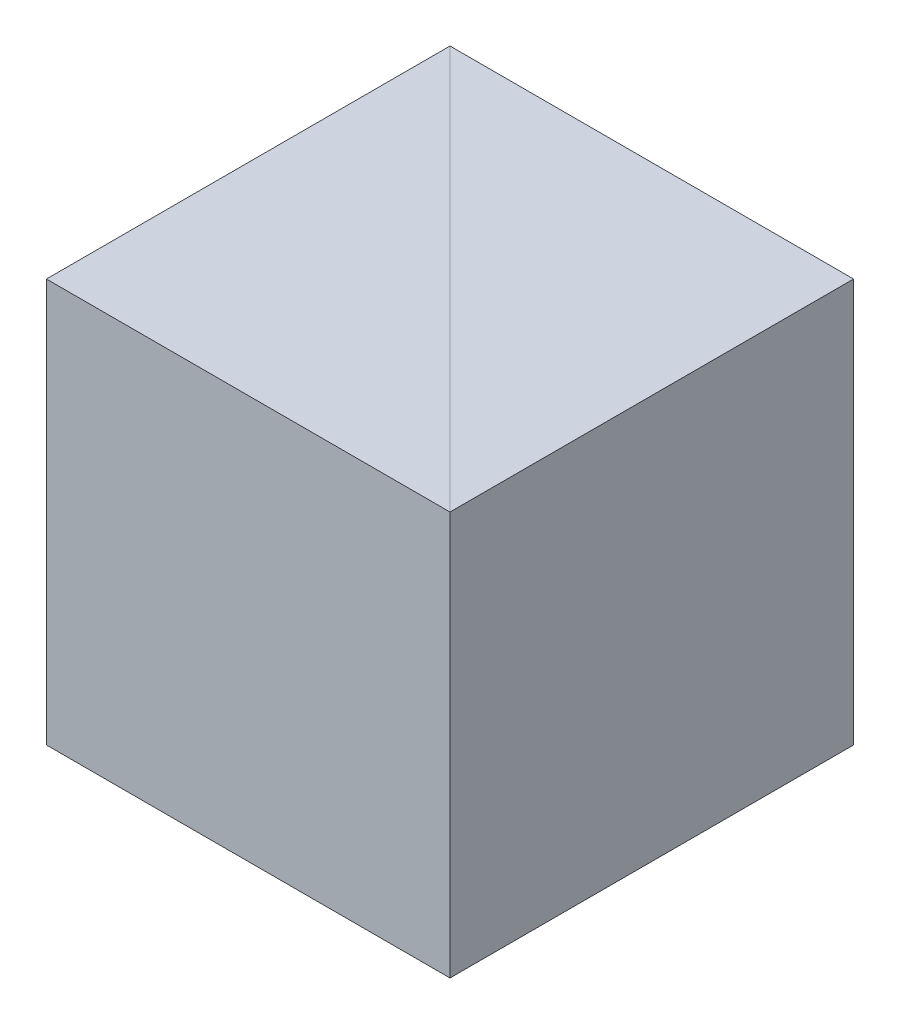
ISO-10303-21;
HEADER;
FILE_DESCRIPTION(('STEP AP214'),'2;1');
FILE_NAME('part.step','',(''),(''),'','','');
FILE_SCHEMA(('AUTOMOTIVE_DESIGN { 1 0 10303 214 1 1 1 1 }'));
ENDSEC;
DATA;
#1=APPLICATION_CONTEXT('core data for automotive mechanical design processes');
#2=APPLICATION_PROTOCOL_DEFINITION('international standard','automotive_design',2000,#1);
#3=PRODUCT_CONTEXT('',#1,'mechanical');
#4=PRODUCT('Part','Part','',(#3));
#5=PRODUCT_RELATED_PRODUCT_CATEGORY('part','',(#4));
#6=PRODUCT_DEFINITION_FORMATION('','',#4);
#7=PRODUCT_DEFINITION_CONTEXT('part definition',#1,'design');
#8=PRODUCT_DEFINITION('design','',#6,#7);
#9=PRODUCT_DEFINITION_SHAPE('','',#8);
#10=(LENGTH_UNIT() NAMED_UNIT(*) SI_UNIT(.MILLI.,.METRE.));
#11=(NAMED_UNIT(*) PLANE_ANGLE_UNIT() SI_UNIT($,.RADIAN.));
#12=(NAMED_UNIT(*) SI_UNIT($,.STERADIAN.) SOLID_ANGLE_UNIT());
#13=UNCERTAINTY_MEASURE_WITH_UNIT(LENGTH_MEASURE(1.E-05),#10,'distance_accuracy_value','');
#14=(GEOMETRIC_REPRESENTATION_CONTEXT(3) GLOBAL_UNCERTAINTY_ASSIGNED_CONTEXT((#13)) GLOBAL_UNIT_ASSIGNED_CONTEXT((#10,
#11,#12)) REPRESENTATION_CONTEXT('',''));
#15=CARTESIAN_POINT('',(0.,0.,0.));
#16=DIRECTION('',(0.,0.,1.));
#17=DIRECTION('',(1.,0.,0.));
#18=AXIS2_PLACEMENT_3D('',#15,#16,#17);
#19=CARTESIAN_POINT('',(0.,20.,0.));
#20=DIRECTION('',(0.707106781186547,0.,-0.707106781186548));
#21=DIRECTION('',(-0.707106781186548,0.,-0.707106781186547));
#22=AXIS2_PLACEMENT_3D('',#19,#20,#21);
#23=PLANE('',#22);
#24=DIRECTION('',(0.707106781186548,0.,0.707106781186547));
#25=VECTOR('',#24,1.);
#26=CARTESIAN_POINT('',(0.,0.,0.));
#27=LINE('',#26,#25);
#28=CARTESIAN_POINT('',(-20.,0.,-20.));
#29=VERTEX_POINT('',#28);
#30=CARTESIAN_POINT('',(0.,0.,0.));
#31=VERTEX_POINT('',#30);
#32=EDGE_CURVE('E99',#29,#31,#27,.T.);
#33=ORIENTED_EDGE('',*,*,#32,.F.);
#34=DIRECTION('',(0.,-1.,0.));
#35=VECTOR('',#34,1.);
#36=CARTESIAN_POINT('',(-20.,20.,-20.));
#37=LINE('',#36,#35);
#38=CARTESIAN_POINT('',(-20.,20.,-20.));
#39=VERTEX_POINT('',#38);
#40=EDGE_CURVE('E12',#39,#29,#37,.T.);
#41=ORIENTED_EDGE('',*,*,#40,.F.);
#42=DIRECTION('',(0.707106781186548,0.,0.707106781186547));
#43=VECTOR('',#42,1.);
#44=CARTESIAN_POINT('',(0.,20.,0.));
#45=LINE('',#44,#43);
#46=CARTESIAN_POINT('',(0.,20.,0.));
#47=VERTEX_POINT('',#46);
#48=EDGE_CURVE('E91',#39,#47,#45,.T.);
#49=ORIENTED_EDGE('',*,*,#48,.T.);
#50=DIRECTION('',(0.,-1.,0.));
#51=VECTOR('',#50,1.);
#52=CARTESIAN_POINT('',(0.,20.,0.));
#53=LINE('',#52,#51);
#54=EDGE_CURVE('E50',#47,#31,#53,.T.);
#55=ORIENTED_EDGE('',*,*,#54,.T.);
#56=EDGE_LOOP('',(#33,#41,#49,#55));
#57=FACE_BOUND('',#56,.T.);
#58=ADVANCED_FACE('F47',(#57),#23,.T.);
#59=CARTESIAN_POINT('',(-20.,20.,-20.));
#60=DIRECTION('',(-1.,0.,0.));
#61=DIRECTION('',(0.,0.,1.));
#62=AXIS2_PLACEMENT_3D('',#59,#60,#61);
#63=PLANE('',#62);
#64=DIRECTION('',(0.,0.,-1.));
#65=VECTOR('',#64,1.);
#66=CARTESIAN_POINT('',(-20.,0.,-20.));
#67=LINE('',#66,#65);
#68=CARTESIAN_POINT('',(-20.,0.,0.));
#69=VERTEX_POINT('',#68);
#70=EDGE_CURVE('E93',#69,#29,#67,.T.);
#71=ORIENTED_EDGE('',*,*,#70,.F.);
#72=DIRECTION('',(0.,-1.,0.));
#73=VECTOR('',#72,1.);
#74=CARTESIAN_POINT('',(-20.,20.,0.));
#75=LINE('',#74,#73);
#76=CARTESIAN_POINT('',(-20.,20.,0.));
#77=VERTEX_POINT('',#76);
#78=EDGE_CURVE('E56',#77,#69,#75,.T.);
#79=ORIENTED_EDGE('',*,*,#78,.F.);
#80=DIRECTION('',(0.,0.,-1.));
#81=VECTOR('',#80,1.);
#82=CARTESIAN_POINT('',(-20.,20.,-20.));
#83=LINE('',#82,#81);
#84=EDGE_CURVE('E88',#77,#39,#83,.T.);
#85=ORIENTED_EDGE('',*,*,#84,.T.);
#86=ORIENTED_EDGE('',*,*,#40,.T.);
#87=EDGE_LOOP('',(#71,#79,#85,#86));
#88=FACE_BOUND('',#87,.T.);
#89=ADVANCED_FACE('F103',(#88),#63,.T.);
#90=CARTESIAN_POINT('',(-20.,20.,0.));
#91=DIRECTION('',(0.,0.,1.));
#92=DIRECTION('',(1.,0.,0.));
#93=AXIS2_PLACEMENT_3D('',#90,#91,#92);
#94=PLANE('',#93);
#95=DIRECTION('',(-1.,0.,0.));
#96=VECTOR('',#95,1.);
#97=CARTESIAN_POINT('',(-20.,0.,0.));
#98=LINE('',#97,#96);
#99=EDGE_CURVE('E86',#31,#69,#98,.T.);
#100=ORIENTED_EDGE('',*,*,#99,.F.);
#101=ORIENTED_EDGE('',*,*,#54,.F.);
#102=DIRECTION('',(-1.,0.,0.));
#103=VECTOR('',#102,1.);
#104=CARTESIAN_POINT('',(-20.,20.,0.));
#105=LINE('',#104,#103);
#106=EDGE_CURVE('E84',#47,#77,#105,.T.);
#107=ORIENTED_EDGE('',*,*,#106,.T.);
#108=ORIENTED_EDGE('',*,*,#78,.T.);
#109=EDGE_LOOP('',(#100,#101,#107,#108));
#110=FACE_BOUND('',#109,.T.);
#111=ADVANCED_FACE('F83',(#110),#94,.T.);
#112=CARTESIAN_POINT('',(0.,20.,0.));
#113=DIRECTION('',(0.,1.,0.));
#114=DIRECTION('',(0.,0.,1.));
#115=AXIS2_PLACEMENT_3D('',#112,#113,#114);
#116=PLANE('',#115);
#117=ORIENTED_EDGE('',*,*,#48,.F.);
#118=ORIENTED_EDGE('',*,*,#84,.F.);
#119=ORIENTED_EDGE('',*,*,#106,.F.);
#120=EDGE_LOOP('',(#117,#118,#119));
#121=FACE_BOUND('',#120,.T.);
#122=ADVANCED_FACE('F90',(#121),#116,.T.);
#123=CARTESIAN_POINT('',(0.,0.,0.));
#124=DIRECTION('',(0.,1.,0.));
#125=DIRECTION('',(0.,0.,1.));
#126=AXIS2_PLACEMENT_3D('',#123,#124,#125);
#127=PLANE('',#126);
#128=ORIENTED_EDGE('',*,*,#32,.T.);
#129=ORIENTED_EDGE('',*,*,#99,.T.);
#130=ORIENTED_EDGE('',*,*,#70,.T.);
#131=EDGE_LOOP('',(#128,#129,#130));
#132=FACE_BOUND('',#131,.T.);
#133=ADVANCED_FACE('F102',(#132),#127,.F.);
#134=CLOSED_SHELL('',(#58,#89,#111,#122,#133));
#135=MANIFOLD_SOLID_BREP('B2',#134);
#136=CARTESIAN_POINT('',(-20.,20.,-20.));
#137=DIRECTION('',(0.707106781186547,0.,-0.707106781186548));
#138=DIRECTION('',(-0.707106781186548,0.,-0.707106781186547));
#139=AXIS2_PLACEMENT_3D('',#136,#137,#138);
#140=PLANE('',#139);
#141=DIRECTION('',(0.707106781186548,0.,0.707106781186547));
#142=VECTOR('',#141,1.);
#143=CARTESIAN_POINT('',(-20.,0.,-20.));
#144=LINE('',#143,#142);
#145=CARTESIAN_POINT('',(-20.,0.,-20.));
#146=VERTEX_POINT('',#145);
#147=CARTESIAN_POINT('',(0.,0.,0.));
#148=VERTEX_POINT('',#147);
#149=EDGE_CURVE('E192',#146,#148,#144,.T.);
#150=ORIENTED_EDGE('',*,*,#149,.T.);
#151=DIRECTION('',(0.,-1.,0.));
#152=VECTOR('',#151,1.);
#153=CARTESIAN_POINT('',(0.,20.,0.));
#154=LINE('',#153,#152);
#155=CARTESIAN_POINT('',(0.,20.,0.));
#156=VERTEX_POINT('',#155);
#157=EDGE_CURVE('E45',#156,#148,#154,.T.);
#158=ORIENTED_EDGE('',*,*,#157,.F.);
#159=DIRECTION('',(0.707106781186548,0.,0.707106781186547));
#160=VECTOR('',#159,1.);
#161=CARTESIAN_POINT('',(-20.,20.,-20.));
#162=LINE('',#161,#160);
#163=CARTESIAN_POINT('',(-20.,20.,-20.));
#164=VERTEX_POINT('',#163);
#165=EDGE_CURVE('E185',#164,#156,#162,.T.);
#166=ORIENTED_EDGE('',*,*,#165,.F.);
#167=DIRECTION('',(0.,-1.,0.));
#168=VECTOR('',#167,1.);
#169=CARTESIAN_POINT('',(-20.,20.,-20.));
#170=LINE('',#169,#168);
#171=EDGE_CURVE('E193',#164,#146,#170,.T.);
#172=ORIENTED_EDGE('',*,*,#171,.T.);
#173=EDGE_LOOP('',(#150,#158,#166,#172));
#174=FACE_BOUND('',#173,.T.);
#175=ADVANCED_FACE('F145',(#174),#140,.F.);
#176=CARTESIAN_POINT('',(0.,20.,0.));
#177=DIRECTION('',(-1.,0.,0.));
#178=DIRECTION('',(0.,0.,1.));
#179=AXIS2_PLACEMENT_3D('',#176,#177,#178);
#180=PLANE('',#179);
#181=DIRECTION('',(0.,0.,-1.));
#182=VECTOR('',#181,1.);
#183=CARTESIAN_POINT('',(0.,0.,0.));
#184=LINE('',#183,#182);
#185=CARTESIAN_POINT('',(0.,0.,-20.));
#186=VERTEX_POINT('',#185);
#187=EDGE_CURVE('E173',#148,#186,#184,.T.);
#188=ORIENTED_EDGE('',*,*,#187,.T.);
#189=DIRECTION('',(0.,-1.,0.));
#190=VECTOR('',#189,1.);
#191=CARTESIAN_POINT('',(0.,20.,-20.));
#192=LINE('',#191,#190);
#193=CARTESIAN_POINT('',(0.,20.,-20.));
#194=VERTEX_POINT('',#193);
#195=EDGE_CURVE('E153',#194,#186,#192,.T.);
#196=ORIENTED_EDGE('',*,*,#195,.F.);
#197=DIRECTION('',(0.,0.,-1.));
#198=VECTOR('',#197,1.);
#199=CARTESIAN_POINT('',(0.,20.,0.));
#200=LINE('',#199,#198);
#201=EDGE_CURVE('E181',#156,#194,#200,.T.);
#202=ORIENTED_EDGE('',*,*,#201,.F.);
#203=ORIENTED_EDGE('',*,*,#157,.T.);
#204=EDGE_LOOP('',(#188,#196,#202,#203));
#205=FACE_BOUND('',#204,.T.);
#206=ADVANCED_FACE('F182',(#205),#180,.F.);
#207=CARTESIAN_POINT('',(0.,20.,-20.));
#208=DIRECTION('',(0.,0.,1.));
#209=DIRECTION('',(1.,0.,0.));
#210=AXIS2_PLACEMENT_3D('',#207,#208,#209);
#211=PLANE('',#210);
#212=DIRECTION('',(-1.,0.,0.));
#213=VECTOR('',#212,1.);
#214=CARTESIAN_POINT('',(0.,0.,-20.));
#215=LINE('',#214,#213);
#216=EDGE_CURVE('E178',#186,#146,#215,.T.);
#217=ORIENTED_EDGE('',*,*,#216,.T.);
#218=ORIENTED_EDGE('',*,*,#171,.F.);
#219=DIRECTION('',(-1.,0.,0.));
#220=VECTOR('',#219,1.);
#221=CARTESIAN_POINT('',(0.,20.,-20.));
#222=LINE('',#221,#220);
#223=EDGE_CURVE('E161',#194,#164,#222,.T.);
#224=ORIENTED_EDGE('',*,*,#223,.F.);
#225=ORIENTED_EDGE('',*,*,#195,.T.);
#226=EDGE_LOOP('',(#217,#218,#224,#225));
#227=FACE_BOUND('',#226,.T.);
#228=ADVANCED_FACE('F200',(#227),#211,.F.);
#229=CARTESIAN_POINT('',(0.,20.,0.));
#230=DIRECTION('',(0.,1.,0.));
#231=DIRECTION('',(0.,0.,1.));
#232=AXIS2_PLACEMENT_3D('',#229,#230,#231);
#233=PLANE('',#232);
#234=ORIENTED_EDGE('',*,*,#165,.T.);
#235=ORIENTED_EDGE('',*,*,#201,.T.);
#236=ORIENTED_EDGE('',*,*,#223,.T.);
#237=EDGE_LOOP('',(#234,#235,#236));
#238=FACE_BOUND('',#237,.T.);
#239=ADVANCED_FACE('F188',(#238),#233,.T.);
#240=CARTESIAN_POINT('',(0.,0.,0.));
#241=DIRECTION('',(0.,1.,0.));
#242=DIRECTION('',(0.,0.,1.));
#243=AXIS2_PLACEMENT_3D('',#240,#241,#242);
#244=PLANE('',#243);
#245=ORIENTED_EDGE('',*,*,#149,.F.);
#246=ORIENTED_EDGE('',*,*,#216,.F.);
#247=ORIENTED_EDGE('',*,*,#187,.F.);
#248=EDGE_LOOP('',(#245,#246,#247));
#249=FACE_BOUND('',#248,.T.);
#250=ADVANCED_FACE('F201',(#249),#244,.F.);
#251=CLOSED_SHELL('',(#175,#206,#228,#239,#250));
#252=MANIFOLD_SOLID_BREP('B6',#251);
#253=ADVANCED_BREP_SHAPE_REPRESENTATION('',(#18,#135,#252),#14);
#254=SHAPE_DEFINITION_REPRESENTATION(#9,#253);
ENDSEC;
END-ISO-10303-21;
